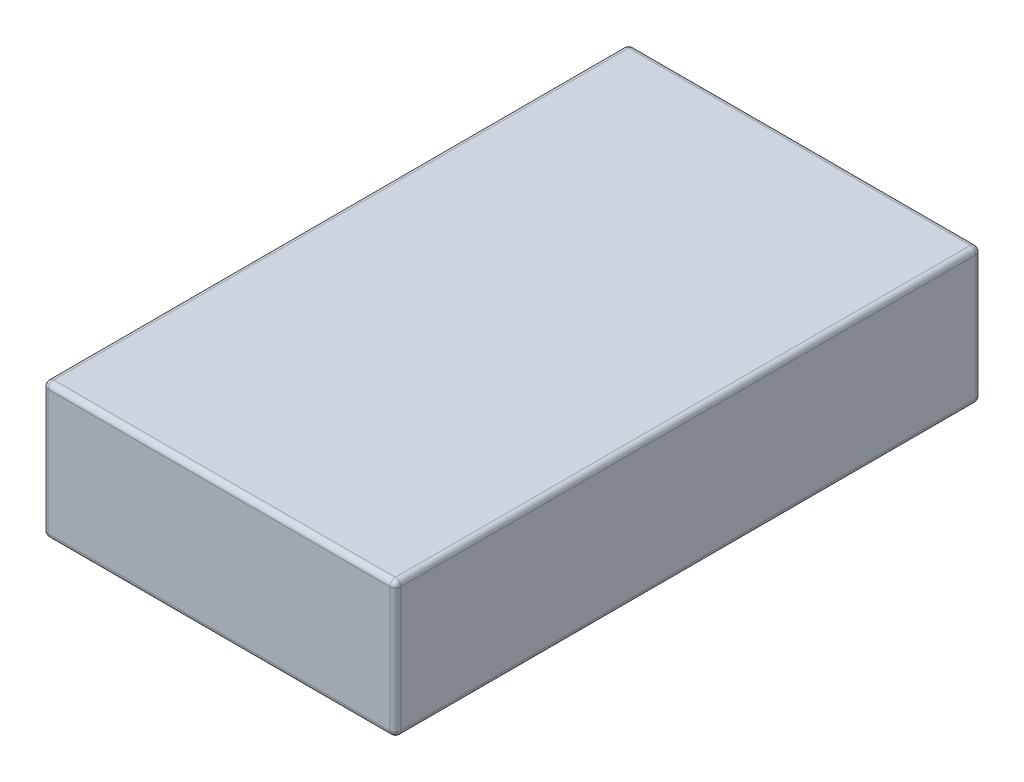
ISO-10303-21;
HEADER;
FILE_DESCRIPTION(('STEP AP214'),'2;1');
FILE_NAME('part.step','',(''),(''),'','','');
FILE_SCHEMA(('AUTOMOTIVE_DESIGN { 1 0 10303 214 1 1 1 1 }'));
ENDSEC;
DATA;
#1=APPLICATION_CONTEXT('core data for automotive mechanical design processes');
#2=APPLICATION_PROTOCOL_DEFINITION('international standard','automotive_design',2000,#1);
#3=PRODUCT_CONTEXT('',#1,'mechanical');
#4=PRODUCT('Part','Part','',(#3));
#5=PRODUCT_RELATED_PRODUCT_CATEGORY('part','',(#4));
#6=PRODUCT_DEFINITION_FORMATION('','',#4);
#7=PRODUCT_DEFINITION_CONTEXT('part definition',#1,'design');
#8=PRODUCT_DEFINITION('design','',#6,#7);
#9=PRODUCT_DEFINITION_SHAPE('','',#8);
#10=(LENGTH_UNIT() NAMED_UNIT(*) SI_UNIT(.MILLI.,.METRE.));
#11=(NAMED_UNIT(*) PLANE_ANGLE_UNIT() SI_UNIT($,.RADIAN.));
#12=(NAMED_UNIT(*) SI_UNIT($,.STERADIAN.) SOLID_ANGLE_UNIT());
#13=UNCERTAINTY_MEASURE_WITH_UNIT(LENGTH_MEASURE(1.E-05),#10,'distance_accuracy_value','');
#14=(GEOMETRIC_REPRESENTATION_CONTEXT(3) GLOBAL_UNCERTAINTY_ASSIGNED_CONTEXT((#13)) GLOBAL_UNIT_ASSIGNED_CONTEXT((#10,
#11,#12)) REPRESENTATION_CONTEXT('',''));
#15=CARTESIAN_POINT('',(0.,0.,0.));
#16=DIRECTION('',(0.,0.,1.));
#17=DIRECTION('',(1.,0.,0.));
#18=AXIS2_PLACEMENT_3D('',#15,#16,#17);
#19=CARTESIAN_POINT('',(32.5,25.,54.));
#20=DIRECTION('',(-1.,0.,0.));
#21=DIRECTION('',(0.,0.,1.));
#22=AXIS2_PLACEMENT_3D('',#19,#20,#21);
#23=PLANE('',#22);
#24=DIRECTION('',(0.,0.,-1.));
#25=VECTOR('',#24,1.);
#26=CARTESIAN_POINT('',(32.5,1.,-54.));
#27=LINE('',#26,#25);
#28=CARTESIAN_POINT('',(32.5,1.,53.));
#29=VERTEX_POINT('',#28);
#30=CARTESIAN_POINT('',(32.5,1.,-53.));
#31=VERTEX_POINT('',#30);
#32=EDGE_CURVE('E218',#29,#31,#27,.T.);
#33=ORIENTED_EDGE('',*,*,#32,.T.);
#34=DIRECTION('',(0.,-1.,0.));
#35=VECTOR('',#34,1.);
#36=CARTESIAN_POINT('',(32.5,25.,-53.));
#37=LINE('',#36,#35);
#38=CARTESIAN_POINT('',(32.5,24.,-53.));
#39=VERTEX_POINT('',#38);
#40=EDGE_CURVE('E213',#31,#39,#37,.F.);
#41=ORIENTED_EDGE('',*,*,#40,.T.);
#42=DIRECTION('',(0.,0.,-1.));
#43=VECTOR('',#42,1.);
#44=CARTESIAN_POINT('',(32.5,24.,54.));
#45=LINE('',#44,#43);
#46=CARTESIAN_POINT('',(32.5,24.,53.));
#47=VERTEX_POINT('',#46);
#48=EDGE_CURVE('E210',#39,#47,#45,.F.);
#49=ORIENTED_EDGE('',*,*,#48,.T.);
#50=DIRECTION('',(0.,-1.,0.));
#51=VECTOR('',#50,1.);
#52=CARTESIAN_POINT('',(32.5,25.,53.));
#53=LINE('',#52,#51);
#54=EDGE_CURVE('E214',#47,#29,#53,.T.);
#55=ORIENTED_EDGE('',*,*,#54,.T.);
#56=EDGE_LOOP('',(#33,#41,#49,#55));
#57=FACE_BOUND('',#56,.T.);
#58=ADVANCED_FACE('F34',(#57),#23,.F.);
#59=CARTESIAN_POINT('',(-32.5,25.,-54.));
#60=DIRECTION('',(0.,0.,1.));
#61=DIRECTION('',(1.,0.,0.));
#62=AXIS2_PLACEMENT_3D('',#59,#60,#61);
#63=PLANE('',#62);
#64=DIRECTION('',(0.,-1.,0.));
#65=VECTOR('',#64,1.);
#66=CARTESIAN_POINT('',(31.5,25.,-54.));
#67=LINE('',#66,#65);
#68=CARTESIAN_POINT('',(31.5,24.,-54.));
#69=VERTEX_POINT('',#68);
#70=CARTESIAN_POINT('',(31.5,1.,-54.));
#71=VERTEX_POINT('',#70);
#72=EDGE_CURVE('E278',#69,#71,#67,.T.);
#73=ORIENTED_EDGE('',*,*,#72,.T.);
#74=DIRECTION('',(-1.,0.,0.));
#75=VECTOR('',#74,1.);
#76=CARTESIAN_POINT('',(-32.5,1.,-54.));
#77=LINE('',#76,#75);
#78=CARTESIAN_POINT('',(-31.5,1.,-54.));
#79=VERTEX_POINT('',#78);
#80=EDGE_CURVE('E280',#71,#79,#77,.T.);
#81=ORIENTED_EDGE('',*,*,#80,.T.);
#82=DIRECTION('',(0.,-1.,0.));
#83=VECTOR('',#82,1.);
#84=CARTESIAN_POINT('',(-31.5,25.,-54.));
#85=LINE('',#84,#83);
#86=CARTESIAN_POINT('',(-31.5,24.,-54.));
#87=VERTEX_POINT('',#86);
#88=EDGE_CURVE('E273',#79,#87,#85,.F.);
#89=ORIENTED_EDGE('',*,*,#88,.T.);
#90=DIRECTION('',(-1.,0.,0.));
#91=VECTOR('',#90,1.);
#92=CARTESIAN_POINT('',(-32.5,24.,-54.));
#93=LINE('',#92,#91);
#94=EDGE_CURVE('E271',#87,#69,#93,.F.);
#95=ORIENTED_EDGE('',*,*,#94,.T.);
#96=EDGE_LOOP('',(#73,#81,#89,#95));
#97=FACE_BOUND('',#96,.T.);
#98=ADVANCED_FACE('F306',(#97),#63,.F.);
#99=CARTESIAN_POINT('',(-32.5,25.,54.));
#100=DIRECTION('',(1.,0.,0.));
#101=DIRECTION('',(0.,0.,-1.));
#102=AXIS2_PLACEMENT_3D('',#99,#100,#101);
#103=PLANE('',#102);
#104=DIRECTION('',(0.,-1.,0.));
#105=VECTOR('',#104,1.);
#106=CARTESIAN_POINT('',(-32.5,25.,-53.));
#107=LINE('',#106,#105);
#108=CARTESIAN_POINT('',(-32.5,24.,-53.));
#109=VERTEX_POINT('',#108);
#110=CARTESIAN_POINT('',(-32.5,1.,-53.));
#111=VERTEX_POINT('',#110);
#112=EDGE_CURVE('E132',#109,#111,#107,.T.);
#113=ORIENTED_EDGE('',*,*,#112,.T.);
#114=DIRECTION('',(0.,0.,1.));
#115=VECTOR('',#114,1.);
#116=CARTESIAN_POINT('',(-32.5,1.,54.));
#117=LINE('',#116,#115);
#118=CARTESIAN_POINT('',(-32.5,1.,53.));
#119=VERTEX_POINT('',#118);
#120=EDGE_CURVE('E128',#111,#119,#117,.T.);
#121=ORIENTED_EDGE('',*,*,#120,.T.);
#122=DIRECTION('',(0.,-1.,0.));
#123=VECTOR('',#122,1.);
#124=CARTESIAN_POINT('',(-32.5,25.,53.));
#125=LINE('',#124,#123);
#126=CARTESIAN_POINT('',(-32.5,24.,53.));
#127=VERTEX_POINT('',#126);
#128=EDGE_CURVE('E122',#119,#127,#125,.F.);
#129=ORIENTED_EDGE('',*,*,#128,.T.);
#130=DIRECTION('',(0.,0.,1.));
#131=VECTOR('',#130,1.);
#132=CARTESIAN_POINT('',(-32.5,24.,54.));
#133=LINE('',#132,#131);
#134=EDGE_CURVE('E125',#127,#109,#133,.F.);
#135=ORIENTED_EDGE('',*,*,#134,.T.);
#136=EDGE_LOOP('',(#113,#121,#129,#135));
#137=FACE_BOUND('',#136,.T.);
#138=ADVANCED_FACE('F124',(#137),#103,.F.);
#139=CARTESIAN_POINT('',(-32.5,25.,54.));
#140=DIRECTION('',(0.,0.,-1.));
#141=DIRECTION('',(-1.,0.,0.));
#142=AXIS2_PLACEMENT_3D('',#139,#140,#141);
#143=PLANE('',#142);
#144=DIRECTION('',(1.,0.,0.));
#145=VECTOR('',#144,1.);
#146=CARTESIAN_POINT('',(-32.5,24.,54.));
#147=LINE('',#146,#145);
#148=CARTESIAN_POINT('',(31.5,24.,54.));
#149=VERTEX_POINT('',#148);
#150=CARTESIAN_POINT('',(-31.5,24.,54.));
#151=VERTEX_POINT('',#150);
#152=EDGE_CURVE('E229',#149,#151,#147,.F.);
#153=ORIENTED_EDGE('',*,*,#152,.T.);
#154=DIRECTION('',(0.,-1.,0.));
#155=VECTOR('',#154,1.);
#156=CARTESIAN_POINT('',(-31.5,25.,54.));
#157=LINE('',#156,#155);
#158=CARTESIAN_POINT('',(-31.5,1.,54.));
#159=VERTEX_POINT('',#158);
#160=EDGE_CURVE('E154',#151,#159,#157,.T.);
#161=ORIENTED_EDGE('',*,*,#160,.T.);
#162=DIRECTION('',(1.,0.,0.));
#163=VECTOR('',#162,1.);
#164=CARTESIAN_POINT('',(32.5,1.,54.));
#165=LINE('',#164,#163);
#166=CARTESIAN_POINT('',(31.5,1.,54.));
#167=VERTEX_POINT('',#166);
#168=EDGE_CURVE('E222',#159,#167,#165,.T.);
#169=ORIENTED_EDGE('',*,*,#168,.T.);
#170=DIRECTION('',(0.,-1.,0.));
#171=VECTOR('',#170,1.);
#172=CARTESIAN_POINT('',(31.5,25.,54.));
#173=LINE('',#172,#171);
#174=EDGE_CURVE('E224',#167,#149,#173,.F.);
#175=ORIENTED_EDGE('',*,*,#174,.T.);
#176=EDGE_LOOP('',(#153,#161,#169,#175));
#177=FACE_BOUND('',#176,.T.);
#178=ADVANCED_FACE('F490',(#177),#143,.F.);
#179=CARTESIAN_POINT('',(0.,25.,0.));
#180=DIRECTION('',(0.,-1.,0.));
#181=DIRECTION('',(0.,0.,-1.));
#182=AXIS2_PLACEMENT_3D('',#179,#180,#181);
#183=PLANE('',#182);
#184=DIRECTION('',(1.,0.,0.));
#185=VECTOR('',#184,1.);
#186=CARTESIAN_POINT('',(0.,25.,53.));
#187=LINE('',#186,#185);
#188=CARTESIAN_POINT('',(-31.5,25.,53.));
#189=VERTEX_POINT('',#188);
#190=CARTESIAN_POINT('',(31.5,25.,53.));
#191=VERTEX_POINT('',#190);
#192=EDGE_CURVE('E43',#189,#191,#187,.T.);
#193=ORIENTED_EDGE('',*,*,#192,.T.);
#194=DIRECTION('',(0.,0.,-1.));
#195=VECTOR('',#194,1.);
#196=CARTESIAN_POINT('',(31.5,25.,0.));
#197=LINE('',#196,#195);
#198=CARTESIAN_POINT('',(31.5,25.,-53.));
#199=VERTEX_POINT('',#198);
#200=EDGE_CURVE('E11',#191,#199,#197,.T.);
#201=ORIENTED_EDGE('',*,*,#200,.T.);
#202=DIRECTION('',(-1.,0.,0.));
#203=VECTOR('',#202,1.);
#204=CARTESIAN_POINT('',(0.,25.,-53.));
#205=LINE('',#204,#203);
#206=CARTESIAN_POINT('',(-31.5,25.,-53.));
#207=VERTEX_POINT('',#206);
#208=EDGE_CURVE('E232',#199,#207,#205,.T.);
#209=ORIENTED_EDGE('',*,*,#208,.T.);
#210=DIRECTION('',(0.,0.,1.));
#211=VECTOR('',#210,1.);
#212=CARTESIAN_POINT('',(-31.5,25.,0.));
#213=LINE('',#212,#211);
#214=EDGE_CURVE('E54',#207,#189,#213,.T.);
#215=ORIENTED_EDGE('',*,*,#214,.T.);
#216=EDGE_LOOP('',(#193,#201,#209,#215));
#217=FACE_BOUND('',#216,.T.);
#218=ADVANCED_FACE('F482',(#217),#183,.F.);
#219=CARTESIAN_POINT('',(0.,0.,0.));
#220=DIRECTION('',(0.,-1.,0.));
#221=DIRECTION('',(0.,0.,-1.));
#222=AXIS2_PLACEMENT_3D('',#219,#220,#221);
#223=PLANE('',#222);
#224=DIRECTION('',(1.,0.,0.));
#225=VECTOR('',#224,1.);
#226=CARTESIAN_POINT('',(-32.5,0.,53.));
#227=LINE('',#226,#225);
#228=CARTESIAN_POINT('',(31.5,0.,53.));
#229=VERTEX_POINT('',#228);
#230=CARTESIAN_POINT('',(-31.5,0.,53.));
#231=VERTEX_POINT('',#230);
#232=EDGE_CURVE('E263',#229,#231,#227,.F.);
#233=ORIENTED_EDGE('',*,*,#232,.T.);
#234=DIRECTION('',(0.,0.,1.));
#235=VECTOR('',#234,1.);
#236=CARTESIAN_POINT('',(-31.5,0.,-54.));
#237=LINE('',#236,#235);
#238=CARTESIAN_POINT('',(-31.5,0.,-53.));
#239=VERTEX_POINT('',#238);
#240=EDGE_CURVE('E262',#231,#239,#237,.F.);
#241=ORIENTED_EDGE('',*,*,#240,.T.);
#242=DIRECTION('',(-1.,0.,0.));
#243=VECTOR('',#242,1.);
#244=CARTESIAN_POINT('',(32.5,0.,-53.));
#245=LINE('',#244,#243);
#246=CARTESIAN_POINT('',(31.5,0.,-53.));
#247=VERTEX_POINT('',#246);
#248=EDGE_CURVE('E256',#239,#247,#245,.F.);
#249=ORIENTED_EDGE('',*,*,#248,.T.);
#250=DIRECTION('',(0.,0.,-1.));
#251=VECTOR('',#250,1.);
#252=CARTESIAN_POINT('',(31.5,0.,54.));
#253=LINE('',#252,#251);
#254=EDGE_CURVE('E297',#247,#229,#253,.F.);
#255=ORIENTED_EDGE('',*,*,#254,.T.);
#256=EDGE_LOOP('',(#233,#241,#249,#255));
#257=FACE_BOUND('',#256,.T.);
#258=ADVANCED_FACE('F266',(#257),#223,.T.);
#259=CARTESIAN_POINT('',(31.5,24.,0.));
#260=DIRECTION('',(0.,0.,-1.));
#261=DIRECTION('',(-1.,0.,0.));
#262=AXIS2_PLACEMENT_3D('',#259,#260,#261);
#263=CYLINDRICAL_SURFACE('',#262,1.);
#264=CARTESIAN_POINT('',(31.5,24.,-53.));
#265=DIRECTION('',(0.,0.,-1.));
#266=DIRECTION('',(-1.,0.,0.));
#267=AXIS2_PLACEMENT_3D('',#264,#265,#266);
#268=CIRCLE('',#267,1.);
#269=EDGE_CURVE('E38',#199,#39,#268,.T.);
#270=ORIENTED_EDGE('',*,*,#269,.F.);
#271=ORIENTED_EDGE('',*,*,#200,.F.);
#272=CARTESIAN_POINT('',(31.5,24.,53.));
#273=DIRECTION('',(0.,0.,1.));
#274=DIRECTION('',(1.,0.,0.));
#275=AXIS2_PLACEMENT_3D('',#272,#273,#274);
#276=CIRCLE('',#275,1.);
#277=EDGE_CURVE('E195',#47,#191,#276,.T.);
#278=ORIENTED_EDGE('',*,*,#277,.F.);
#279=ORIENTED_EDGE('',*,*,#48,.F.);
#280=EDGE_LOOP('',(#270,#271,#278,#279));
#281=FACE_BOUND('',#280,.T.);
#282=ADVANCED_FACE('F36',(#281),#263,.T.);
#283=CARTESIAN_POINT('',(31.5,24.,-53.));
#284=DIRECTION('',(0.,0.,1.));
#285=DIRECTION('',(1.,0.,0.));
#286=AXIS2_PLACEMENT_3D('',#283,#284,#285);
#287=SPHERICAL_SURFACE('',#286,1.);
#288=CARTESIAN_POINT('',(31.5,24.,-53.));
#289=DIRECTION('',(1.,0.,0.));
#290=DIRECTION('',(0.,0.,-1.));
#291=AXIS2_PLACEMENT_3D('',#288,#289,#290);
#292=CIRCLE('',#291,1.);
#293=EDGE_CURVE('E191',#199,#69,#292,.F.);
#294=ORIENTED_EDGE('',*,*,#293,.F.);
#295=ORIENTED_EDGE('',*,*,#269,.T.);
#296=CARTESIAN_POINT('',(31.5,24.,-53.));
#297=DIRECTION('',(0.,1.,0.));
#298=DIRECTION('',(0.,0.,1.));
#299=AXIS2_PLACEMENT_3D('',#296,#297,#298);
#300=CIRCLE('',#299,1.);
#301=EDGE_CURVE('E194',#69,#39,#300,.F.);
#302=ORIENTED_EDGE('',*,*,#301,.F.);
#303=EDGE_LOOP('',(#294,#295,#302));
#304=FACE_BOUND('',#303,.T.);
#305=ADVANCED_FACE('F207',(#304),#287,.T.);
#306=CARTESIAN_POINT('',(31.5,24.,53.));
#307=DIRECTION('',(0.,0.,1.));
#308=DIRECTION('',(1.,0.,0.));
#309=AXIS2_PLACEMENT_3D('',#306,#307,#308);
#310=SPHERICAL_SURFACE('',#309,1.);
#311=CARTESIAN_POINT('',(31.5,24.,53.));
#312=DIRECTION('',(0.,1.,0.));
#313=DIRECTION('',(0.,0.,1.));
#314=AXIS2_PLACEMENT_3D('',#311,#312,#313);
#315=CIRCLE('',#314,1.);
#316=EDGE_CURVE('E185',#47,#149,#315,.F.);
#317=ORIENTED_EDGE('',*,*,#316,.F.);
#318=ORIENTED_EDGE('',*,*,#277,.T.);
#319=CARTESIAN_POINT('',(31.5,24.,53.));
#320=DIRECTION('',(1.,0.,0.));
#321=DIRECTION('',(0.,0.,-1.));
#322=AXIS2_PLACEMENT_3D('',#319,#320,#321);
#323=CIRCLE('',#322,1.);
#324=EDGE_CURVE('E188',#149,#191,#323,.F.);
#325=ORIENTED_EDGE('',*,*,#324,.F.);
#326=EDGE_LOOP('',(#317,#318,#325));
#327=FACE_BOUND('',#326,.T.);
#328=ADVANCED_FACE('F455',(#327),#310,.T.);
#329=CARTESIAN_POINT('',(31.5,25.,-53.));
#330=DIRECTION('',(0.,-1.,0.));
#331=DIRECTION('',(0.,0.,-1.));
#332=AXIS2_PLACEMENT_3D('',#329,#330,#331);
#333=CYLINDRICAL_SURFACE('',#332,1.);
#334=ORIENTED_EDGE('',*,*,#301,.T.);
#335=ORIENTED_EDGE('',*,*,#40,.F.);
#336=CARTESIAN_POINT('',(31.5,1.,-53.));
#337=DIRECTION('',(0.,-1.,0.));
#338=DIRECTION('',(0.,0.,-1.));
#339=AXIS2_PLACEMENT_3D('',#336,#337,#338);
#340=CIRCLE('',#339,1.);
#341=EDGE_CURVE('E179',#71,#31,#340,.T.);
#342=ORIENTED_EDGE('',*,*,#341,.F.);
#343=ORIENTED_EDGE('',*,*,#72,.F.);
#344=EDGE_LOOP('',(#334,#335,#342,#343));
#345=FACE_BOUND('',#344,.T.);
#346=ADVANCED_FACE('F307',(#345),#333,.T.);
#347=CARTESIAN_POINT('',(0.,24.,-53.));
#348=DIRECTION('',(-1.,0.,0.));
#349=DIRECTION('',(0.,0.,1.));
#350=AXIS2_PLACEMENT_3D('',#347,#348,#349);
#351=CYLINDRICAL_SURFACE('',#350,1.);
#352=ORIENTED_EDGE('',*,*,#293,.T.);
#353=ORIENTED_EDGE('',*,*,#94,.F.);
#354=CARTESIAN_POINT('',(-31.5,24.,-53.));
#355=DIRECTION('',(-1.,0.,0.));
#356=DIRECTION('',(0.,0.,1.));
#357=AXIS2_PLACEMENT_3D('',#354,#355,#356);
#358=CIRCLE('',#357,1.);
#359=EDGE_CURVE('E176',#207,#87,#358,.T.);
#360=ORIENTED_EDGE('',*,*,#359,.F.);
#361=ORIENTED_EDGE('',*,*,#208,.F.);
#362=EDGE_LOOP('',(#352,#353,#360,#361));
#363=FACE_BOUND('',#362,.T.);
#364=ADVANCED_FACE('F439',(#363),#351,.T.);
#365=CARTESIAN_POINT('',(-31.5,24.,0.));
#366=DIRECTION('',(0.,0.,1.));
#367=DIRECTION('',(1.,0.,0.));
#368=AXIS2_PLACEMENT_3D('',#365,#366,#367);
#369=CYLINDRICAL_SURFACE('',#368,1.);
#370=CARTESIAN_POINT('',(-31.5,24.,53.));
#371=DIRECTION('',(0.,0.,1.));
#372=DIRECTION('',(1.,0.,0.));
#373=AXIS2_PLACEMENT_3D('',#370,#371,#372);
#374=CIRCLE('',#373,1.);
#375=EDGE_CURVE('E138',#189,#127,#374,.T.);
#376=ORIENTED_EDGE('',*,*,#375,.F.);
#377=ORIENTED_EDGE('',*,*,#214,.F.);
#378=CARTESIAN_POINT('',(-31.5,24.,-53.));
#379=DIRECTION('',(0.,0.,-1.));
#380=DIRECTION('',(-1.,0.,0.));
#381=AXIS2_PLACEMENT_3D('',#378,#379,#380);
#382=CIRCLE('',#381,1.);
#383=EDGE_CURVE('E141',#109,#207,#382,.T.);
#384=ORIENTED_EDGE('',*,*,#383,.F.);
#385=ORIENTED_EDGE('',*,*,#134,.F.);
#386=EDGE_LOOP('',(#376,#377,#384,#385));
#387=FACE_BOUND('',#386,.T.);
#388=ADVANCED_FACE('F137',(#387),#369,.T.);
#389=CARTESIAN_POINT('',(0.,24.,53.));
#390=DIRECTION('',(1.,0.,0.));
#391=DIRECTION('',(0.,0.,-1.));
#392=AXIS2_PLACEMENT_3D('',#389,#390,#391);
#393=CYLINDRICAL_SURFACE('',#392,1.);
#394=ORIENTED_EDGE('',*,*,#324,.T.);
#395=ORIENTED_EDGE('',*,*,#192,.F.);
#396=CARTESIAN_POINT('',(-31.5,24.,53.));
#397=DIRECTION('',(-1.,0.,0.));
#398=DIRECTION('',(0.,0.,1.));
#399=AXIS2_PLACEMENT_3D('',#396,#397,#398);
#400=CIRCLE('',#399,1.);
#401=EDGE_CURVE('E150',#151,#189,#400,.T.);
#402=ORIENTED_EDGE('',*,*,#401,.F.);
#403=ORIENTED_EDGE('',*,*,#152,.F.);
#404=EDGE_LOOP('',(#394,#395,#402,#403));
#405=FACE_BOUND('',#404,.T.);
#406=ADVANCED_FACE('F423',(#405),#393,.T.);
#407=CARTESIAN_POINT('',(31.5,25.,53.));
#408=DIRECTION('',(0.,-1.,0.));
#409=DIRECTION('',(0.,0.,-1.));
#410=AXIS2_PLACEMENT_3D('',#407,#408,#409);
#411=CYLINDRICAL_SURFACE('',#410,1.);
#412=ORIENTED_EDGE('',*,*,#316,.T.);
#413=ORIENTED_EDGE('',*,*,#174,.F.);
#414=CARTESIAN_POINT('',(31.5,1.,53.));
#415=DIRECTION('',(0.,-1.,0.));
#416=DIRECTION('',(0.,0.,-1.));
#417=AXIS2_PLACEMENT_3D('',#414,#415,#416);
#418=CIRCLE('',#417,1.);
#419=EDGE_CURVE('E171',#29,#167,#418,.T.);
#420=ORIENTED_EDGE('',*,*,#419,.F.);
#421=ORIENTED_EDGE('',*,*,#54,.F.);
#422=EDGE_LOOP('',(#412,#413,#420,#421));
#423=FACE_BOUND('',#422,.T.);
#424=ADVANCED_FACE('F291',(#423),#411,.T.);
#425=CARTESIAN_POINT('',(31.5,1.,54.));
#426=DIRECTION('',(0.,0.,1.));
#427=DIRECTION('',(1.,0.,0.));
#428=AXIS2_PLACEMENT_3D('',#425,#426,#427);
#429=CYLINDRICAL_SURFACE('',#428,1.);
#430=CARTESIAN_POINT('',(31.5,1.,-53.));
#431=DIRECTION('',(0.,0.,-1.));
#432=DIRECTION('',(-1.,0.,0.));
#433=AXIS2_PLACEMENT_3D('',#430,#431,#432);
#434=CIRCLE('',#433,1.);
#435=EDGE_CURVE('E182',#31,#247,#434,.T.);
#436=ORIENTED_EDGE('',*,*,#435,.F.);
#437=ORIENTED_EDGE('',*,*,#32,.F.);
#438=CARTESIAN_POINT('',(31.5,1.,53.));
#439=DIRECTION('',(0.,0.,1.));
#440=DIRECTION('',(1.,0.,0.));
#441=AXIS2_PLACEMENT_3D('',#438,#439,#440);
#442=CIRCLE('',#441,1.);
#443=EDGE_CURVE('E168',#229,#29,#442,.T.);
#444=ORIENTED_EDGE('',*,*,#443,.F.);
#445=ORIENTED_EDGE('',*,*,#254,.F.);
#446=EDGE_LOOP('',(#436,#437,#444,#445));
#447=FACE_BOUND('',#446,.T.);
#448=ADVANCED_FACE('F288',(#447),#429,.T.);
#449=CARTESIAN_POINT('',(31.5,1.,-53.));
#450=DIRECTION('',(0.,0.,1.));
#451=DIRECTION('',(1.,0.,0.));
#452=AXIS2_PLACEMENT_3D('',#449,#450,#451);
#453=SPHERICAL_SURFACE('',#452,1.);
#454=ORIENTED_EDGE('',*,*,#341,.T.);
#455=ORIENTED_EDGE('',*,*,#435,.T.);
#456=CARTESIAN_POINT('',(31.5,1.,-53.));
#457=DIRECTION('',(1.,0.,0.));
#458=DIRECTION('',(0.,0.,-1.));
#459=AXIS2_PLACEMENT_3D('',#456,#457,#458);
#460=CIRCLE('',#459,1.);
#461=EDGE_CURVE('E159',#71,#247,#460,.F.);
#462=ORIENTED_EDGE('',*,*,#461,.F.);
#463=EDGE_LOOP('',(#454,#455,#462));
#464=FACE_BOUND('',#463,.T.);
#465=ADVANCED_FACE('F309',(#464),#453,.T.);
#466=CARTESIAN_POINT('',(-31.5,24.,-53.));
#467=DIRECTION('',(0.,0.,1.));
#468=DIRECTION('',(1.,0.,0.));
#469=AXIS2_PLACEMENT_3D('',#466,#467,#468);
#470=SPHERICAL_SURFACE('',#469,1.);
#471=ORIENTED_EDGE('',*,*,#383,.T.);
#472=ORIENTED_EDGE('',*,*,#359,.T.);
#473=CARTESIAN_POINT('',(-31.5,24.,-53.));
#474=DIRECTION('',(0.,1.,0.));
#475=DIRECTION('',(0.,0.,1.));
#476=AXIS2_PLACEMENT_3D('',#473,#474,#475);
#477=CIRCLE('',#476,1.);
#478=EDGE_CURVE('E155',#109,#87,#477,.F.);
#479=ORIENTED_EDGE('',*,*,#478,.F.);
#480=EDGE_LOOP('',(#471,#472,#479));
#481=FACE_BOUND('',#480,.T.);
#482=ADVANCED_FACE('F311',(#481),#470,.T.);
#483=CARTESIAN_POINT('',(-31.5,24.,53.));
#484=DIRECTION('',(0.,0.,1.));
#485=DIRECTION('',(1.,0.,0.));
#486=AXIS2_PLACEMENT_3D('',#483,#484,#485);
#487=SPHERICAL_SURFACE('',#486,1.);
#488=ORIENTED_EDGE('',*,*,#401,.T.);
#489=ORIENTED_EDGE('',*,*,#375,.T.);
#490=CARTESIAN_POINT('',(-31.5,24.,53.));
#491=DIRECTION('',(0.,1.,0.));
#492=DIRECTION('',(0.,0.,1.));
#493=AXIS2_PLACEMENT_3D('',#490,#491,#492);
#494=CIRCLE('',#493,1.);
#495=EDGE_CURVE('E147',#151,#127,#494,.F.);
#496=ORIENTED_EDGE('',*,*,#495,.F.);
#497=EDGE_LOOP('',(#488,#489,#496));
#498=FACE_BOUND('',#497,.T.);
#499=ADVANCED_FACE('F146',(#498),#487,.T.);
#500=CARTESIAN_POINT('',(31.5,1.,53.));
#501=DIRECTION('',(0.,0.,1.));
#502=DIRECTION('',(1.,0.,0.));
#503=AXIS2_PLACEMENT_3D('',#500,#501,#502);
#504=SPHERICAL_SURFACE('',#503,1.);
#505=ORIENTED_EDGE('',*,*,#443,.T.);
#506=ORIENTED_EDGE('',*,*,#419,.T.);
#507=CARTESIAN_POINT('',(31.5,1.,53.));
#508=DIRECTION('',(1.,0.,0.));
#509=DIRECTION('',(0.,0.,-1.));
#510=AXIS2_PLACEMENT_3D('',#507,#508,#509);
#511=CIRCLE('',#510,1.);
#512=EDGE_CURVE('E156',#229,#167,#511,.F.);
#513=ORIENTED_EDGE('',*,*,#512,.F.);
#514=EDGE_LOOP('',(#505,#506,#513));
#515=FACE_BOUND('',#514,.T.);
#516=ADVANCED_FACE('F293',(#515),#504,.T.);
#517=CARTESIAN_POINT('',(-32.5,1.,-53.));
#518=DIRECTION('',(1.,0.,0.));
#519=DIRECTION('',(0.,0.,-1.));
#520=AXIS2_PLACEMENT_3D('',#517,#518,#519);
#521=CYLINDRICAL_SURFACE('',#520,1.);
#522=ORIENTED_EDGE('',*,*,#461,.T.);
#523=ORIENTED_EDGE('',*,*,#248,.F.);
#524=CARTESIAN_POINT('',(-31.5,1.,-53.));
#525=DIRECTION('',(-1.,0.,0.));
#526=DIRECTION('',(0.,0.,1.));
#527=AXIS2_PLACEMENT_3D('',#524,#525,#526);
#528=CIRCLE('',#527,1.);
#529=EDGE_CURVE('E162',#79,#239,#528,.T.);
#530=ORIENTED_EDGE('',*,*,#529,.F.);
#531=ORIENTED_EDGE('',*,*,#80,.F.);
#532=EDGE_LOOP('',(#522,#523,#530,#531));
#533=FACE_BOUND('',#532,.T.);
#534=ADVANCED_FACE('F258',(#533),#521,.T.);
#535=CARTESIAN_POINT('',(-31.5,25.,-53.));
#536=DIRECTION('',(0.,-1.,0.));
#537=DIRECTION('',(0.,0.,-1.));
#538=AXIS2_PLACEMENT_3D('',#535,#536,#537);
#539=CYLINDRICAL_SURFACE('',#538,1.);
#540=ORIENTED_EDGE('',*,*,#478,.T.);
#541=ORIENTED_EDGE('',*,*,#88,.F.);
#542=CARTESIAN_POINT('',(-31.5,1.,-53.));
#543=DIRECTION('',(0.,-1.,0.));
#544=DIRECTION('',(0.,0.,-1.));
#545=AXIS2_PLACEMENT_3D('',#542,#543,#544);
#546=CIRCLE('',#545,1.);
#547=EDGE_CURVE('E245',#111,#79,#546,.T.);
#548=ORIENTED_EDGE('',*,*,#547,.F.);
#549=ORIENTED_EDGE('',*,*,#112,.F.);
#550=EDGE_LOOP('',(#540,#541,#548,#549));
#551=FACE_BOUND('',#550,.T.);
#552=ADVANCED_FACE('F303',(#551),#539,.T.);
#553=CARTESIAN_POINT('',(-31.5,25.,53.));
#554=DIRECTION('',(0.,-1.,0.));
#555=DIRECTION('',(0.,0.,-1.));
#556=AXIS2_PLACEMENT_3D('',#553,#554,#555);
#557=CYLINDRICAL_SURFACE('',#556,1.);
#558=ORIENTED_EDGE('',*,*,#495,.T.);
#559=ORIENTED_EDGE('',*,*,#128,.F.);
#560=CARTESIAN_POINT('',(-31.5,1.,53.));
#561=DIRECTION('',(0.,-1.,0.));
#562=DIRECTION('',(0.,0.,-1.));
#563=AXIS2_PLACEMENT_3D('',#560,#561,#562);
#564=CIRCLE('',#563,1.);
#565=EDGE_CURVE('E242',#159,#119,#564,.T.);
#566=ORIENTED_EDGE('',*,*,#565,.F.);
#567=ORIENTED_EDGE('',*,*,#160,.F.);
#568=EDGE_LOOP('',(#558,#559,#566,#567));
#569=FACE_BOUND('',#568,.T.);
#570=ADVANCED_FACE('F152',(#569),#557,.T.);
#571=CARTESIAN_POINT('',(-32.5,1.,53.));
#572=DIRECTION('',(-1.,0.,0.));
#573=DIRECTION('',(0.,0.,1.));
#574=AXIS2_PLACEMENT_3D('',#571,#572,#573);
#575=CYLINDRICAL_SURFACE('',#574,1.);
#576=ORIENTED_EDGE('',*,*,#512,.T.);
#577=ORIENTED_EDGE('',*,*,#168,.F.);
#578=CARTESIAN_POINT('',(-31.5,1.,53.));
#579=DIRECTION('',(-1.,0.,0.));
#580=DIRECTION('',(0.,0.,1.));
#581=AXIS2_PLACEMENT_3D('',#578,#579,#580);
#582=CIRCLE('',#581,1.);
#583=EDGE_CURVE('E240',#231,#159,#582,.T.);
#584=ORIENTED_EDGE('',*,*,#583,.F.);
#585=ORIENTED_EDGE('',*,*,#232,.F.);
#586=EDGE_LOOP('',(#576,#577,#584,#585));
#587=FACE_BOUND('',#586,.T.);
#588=ADVANCED_FACE('F296',(#587),#575,.T.);
#589=CARTESIAN_POINT('',(-31.5,1.,-53.));
#590=DIRECTION('',(0.,0.,1.));
#591=DIRECTION('',(1.,0.,0.));
#592=AXIS2_PLACEMENT_3D('',#589,#590,#591);
#593=SPHERICAL_SURFACE('',#592,1.);
#594=ORIENTED_EDGE('',*,*,#547,.T.);
#595=ORIENTED_EDGE('',*,*,#529,.T.);
#596=CARTESIAN_POINT('',(-31.5,1.,-53.));
#597=DIRECTION('',(0.,0.,-1.));
#598=DIRECTION('',(-1.,0.,0.));
#599=AXIS2_PLACEMENT_3D('',#596,#597,#598);
#600=CIRCLE('',#599,1.);
#601=EDGE_CURVE('E238',#111,#239,#600,.F.);
#602=ORIENTED_EDGE('',*,*,#601,.F.);
#603=EDGE_LOOP('',(#594,#595,#602));
#604=FACE_BOUND('',#603,.T.);
#605=ADVANCED_FACE('F251',(#604),#593,.T.);
#606=CARTESIAN_POINT('',(-31.5,1.,53.));
#607=DIRECTION('',(0.,0.,1.));
#608=DIRECTION('',(1.,0.,0.));
#609=AXIS2_PLACEMENT_3D('',#606,#607,#608);
#610=SPHERICAL_SURFACE('',#609,1.);
#611=ORIENTED_EDGE('',*,*,#583,.T.);
#612=ORIENTED_EDGE('',*,*,#565,.T.);
#613=CARTESIAN_POINT('',(-31.5,1.,53.));
#614=DIRECTION('',(0.,0.,1.));
#615=DIRECTION('',(1.,0.,0.));
#616=AXIS2_PLACEMENT_3D('',#613,#614,#615);
#617=CIRCLE('',#616,1.);
#618=EDGE_CURVE('E236',#231,#119,#617,.F.);
#619=ORIENTED_EDGE('',*,*,#618,.F.);
#620=EDGE_LOOP('',(#611,#612,#619));
#621=FACE_BOUND('',#620,.T.);
#622=ADVANCED_FACE('F331',(#621),#610,.T.);
#623=CARTESIAN_POINT('',(-31.5,1.,54.));
#624=DIRECTION('',(0.,0.,-1.));
#625=DIRECTION('',(-1.,0.,0.));
#626=AXIS2_PLACEMENT_3D('',#623,#624,#625);
#627=CYLINDRICAL_SURFACE('',#626,1.);
#628=ORIENTED_EDGE('',*,*,#601,.T.);
#629=ORIENTED_EDGE('',*,*,#240,.F.);
#630=ORIENTED_EDGE('',*,*,#618,.T.);
#631=ORIENTED_EDGE('',*,*,#120,.F.);
#632=EDGE_LOOP('',(#628,#629,#630,#631));
#633=FACE_BOUND('',#632,.T.);
#634=ADVANCED_FACE('F328',(#633),#627,.T.);
#635=CLOSED_SHELL('',(#58,#98,#138,#178,#218,#258,#282,#305,#328,#346,#364,#388,#406,#424,#448,
#465,#482,#499,#516,#534,#552,#570,#588,#605,#622,#634));
#636=MANIFOLD_SOLID_BREP('B2',#635);
#637=ADVANCED_BREP_SHAPE_REPRESENTATION('',(#18,#636),#14);
#638=SHAPE_DEFINITION_REPRESENTATION(#9,#637);
ENDSEC;
END-ISO-10303-21;
